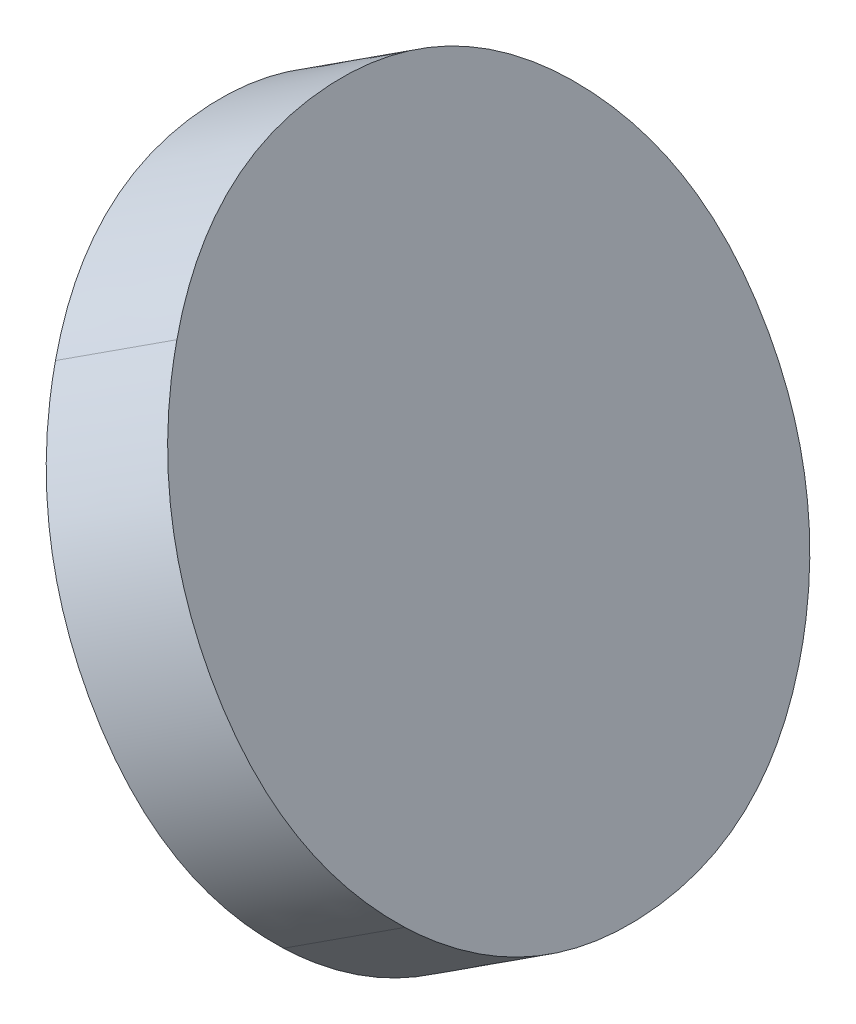
ISO-10303-21;
HEADER;
FILE_DESCRIPTION(('STEP AP214'),'2;1');
FILE_NAME('part.step','',(''),(''),'','','');
FILE_SCHEMA(('AUTOMOTIVE_DESIGN { 1 0 10303 214 1 1 1 1 }'));
ENDSEC;
DATA;
#1=APPLICATION_CONTEXT('core data for automotive mechanical design processes');
#2=APPLICATION_PROTOCOL_DEFINITION('international standard','automotive_design',2000,#1);
#3=PRODUCT_CONTEXT('',#1,'mechanical');
#4=PRODUCT('Part','Part','',(#3));
#5=PRODUCT_RELATED_PRODUCT_CATEGORY('part','',(#4));
#6=PRODUCT_DEFINITION_FORMATION('','',#4);
#7=PRODUCT_DEFINITION_CONTEXT('part definition',#1,'design');
#8=PRODUCT_DEFINITION('design','',#6,#7);
#9=PRODUCT_DEFINITION_SHAPE('','',#8);
#10=(LENGTH_UNIT() NAMED_UNIT(*) SI_UNIT(.MILLI.,.METRE.));
#11=(NAMED_UNIT(*) PLANE_ANGLE_UNIT() SI_UNIT($,.RADIAN.));
#12=(NAMED_UNIT(*) SI_UNIT($,.STERADIAN.) SOLID_ANGLE_UNIT());
#13=UNCERTAINTY_MEASURE_WITH_UNIT(LENGTH_MEASURE(1.E-05),#10,'distance_accuracy_value','');
#14=(GEOMETRIC_REPRESENTATION_CONTEXT(3) GLOBAL_UNCERTAINTY_ASSIGNED_CONTEXT((#13)) GLOBAL_UNIT_ASSIGNED_CONTEXT((#10,
#11,#12)) REPRESENTATION_CONTEXT('',''));
#15=CARTESIAN_POINT('',(0.,0.,0.));
#16=DIRECTION('',(0.,0.,1.));
#17=DIRECTION('',(1.,0.,0.));
#18=AXIS2_PLACEMENT_3D('',#15,#16,#17);
#19=CARTESIAN_POINT('',(7.28335065461328,6.00680934984333,1.91579914241559));
#20=DIRECTION('',(0.852868531952444,0.492403876506103,-0.17364817766693));
#21=DIRECTION('',(0.,-0.332579245006703,-0.943075312894348));
#22=AXIS2_PLACEMENT_3D('',#19,#20,#21);
#23=PLANE('',#22);
#24=CARTESIAN_POINT('',(7.16805054090355,6.2443999051349,2.02322711536579));
#25=CARTESIAN_POINT('',(7.19415428395629,6.17392212869858,1.95158530791309));
#26=CARTESIAN_POINT('',(7.23259707064947,6.09471713593486,1.91579914241559));
#27=CARTESIAN_POINT('',(7.33547992937375,5.91651879739647,1.91579914241559));
#28=CARTESIAN_POINT('',(7.38450520965769,5.84422465411598,1.95158530791309));
#29=CARTESIAN_POINT('',(7.43044004428371,5.78992795390772,2.02322711536579));
#30=B_SPLINE_CURVE_WITH_KNOTS('',3,(#24,#25,#26,#27,#28,#29),.UNSPECIFIED.,.F.,.F.,(4,2,4),(0.,
0.5,1.),.UNSPECIFIED.);
#31=CARTESIAN_POINT('',(7.16805054090355,6.2443999051349,2.02322711536579));
#32=VERTEX_POINT('',#31);
#33=CARTESIAN_POINT('',(7.43044004428371,5.78992795390772,2.02322711536579));
#34=VERTEX_POINT('',#33);
#35=EDGE_CURVE('E19',#32,#34,#30,.T.);
#36=ORIENTED_EDGE('',*,*,#35,.T.);
#37=CARTESIAN_POINT('',(7.43044004428371,5.78992795390772,2.02322711536579));
#38=CARTESIAN_POINT('',(7.4763474442193,5.73565614532244,2.09480476175079));
#39=CARTESIAN_POINT('',(7.50756220143503,5.71327279338527,2.18464408576989));
#40=CARTESIAN_POINT('',(7.54056952787439,5.73232958219027,2.40079692555009));
#41=CARTESIAN_POINT('',(7.5366985670963,5.77049988236137,2.49002206654359));
#42=CARTESIAN_POINT('',(7.51244373829389,5.83727280871904,2.56023914405359));
#43=B_SPLINE_CURVE_WITH_KNOTS('',3,(#37,#38,#39,#40,#41,#42),.UNSPECIFIED.,.F.,.F.,(4,2,4),(0.,
0.5,1.),.UNSPECIFIED.);
#44=CARTESIAN_POINT('',(7.51244373829389,5.83727280871904,2.56023914405359));
#45=VERTEX_POINT('',#44);
#46=EDGE_CURVE('E96',#34,#45,#43,.T.);
#47=ORIENTED_EDGE('',*,*,#46,.T.);
#48=CARTESIAN_POINT('',(7.51244373829389,5.83727280871904,2.56023914405359));
#49=CARTESIAN_POINT('',(7.4881722978072,5.9040768753652,2.63046293638199));
#50=CARTESIAN_POINT('',(7.44998265776649,5.98262697845697,2.66563539316839));
#51=CARTESIAN_POINT('',(7.3457211687353,6.16321317473178,2.66563539316839));
#52=CARTESIAN_POINT('',(7.29611351665096,6.23673244236755,2.63046293638199));
#53=CARTESIAN_POINT('',(7.24903422485724,6.29351146918832,2.56023914405359));
#54=B_SPLINE_CURVE_WITH_KNOTS('',3,(#48,#49,#50,#51,#52,#53),.UNSPECIFIED.,.F.,.F.,(4,2,4),(0.,
0.5,1.),.UNSPECIFIED.);
#55=CARTESIAN_POINT('',(7.24903422485724,6.29351146918832,2.56023914405359));
#56=VERTEX_POINT('',#55);
#57=EDGE_CURVE('E74',#45,#56,#54,.T.);
#58=ORIENTED_EDGE('',*,*,#57,.T.);
#59=CARTESIAN_POINT('',(7.24903422485724,6.29351146918832,2.56023914405359));
#60=CARTESIAN_POINT('',(7.20195595844076,6.35029108801092,2.49002206654359));
#61=CARTESIAN_POINT('',(7.17014714381323,6.37391997164499,2.40079692555009));
#62=CARTESIAN_POINT('',(7.13713981737387,6.35486318284,2.18464408576989));
#63=CARTESIAN_POINT('',(7.14194875826292,6.31485165938316,2.09480476175079));
#64=CARTESIAN_POINT('',(7.16805054090355,6.2443999051349,2.02322711536579));
#65=B_SPLINE_CURVE_WITH_KNOTS('',3,(#59,#60,#61,#62,#63,#64),.UNSPECIFIED.,.F.,.F.,(4,2,4),(0.,
0.5,1.),.UNSPECIFIED.);
#66=EDGE_CURVE('E27',#56,#32,#65,.T.);
#67=ORIENTED_EDGE('',*,*,#66,.T.);
#68=EDGE_LOOP('',(#36,#47,#58,#67));
#69=FACE_BOUND('',#68,.T.);
#70=ADVANCED_FACE('F16',(#69),#23,.F.);
#71=CARTESIAN_POINT('',(7.39989462778347,6.07409604412556,1.89207022312629));
#72=DIRECTION('',(0.852868531952444,0.492403876506103,-0.17364817766693));
#73=DIRECTION('',(0.,-0.332579245006703,-0.943075312894348));
#74=AXIS2_PLACEMENT_3D('',#71,#72,#73);
#75=PLANE('',#74);
#76=CARTESIAN_POINT('',(7.28459451407373,6.31168659941713,1.99949819607649));
#77=CARTESIAN_POINT('',(7.31069825712647,6.24120882298081,1.92785638862379));
#78=CARTESIAN_POINT('',(7.34914104381966,6.16200383021709,1.89207022312629));
#79=CARTESIAN_POINT('',(7.45202390254394,5.98380549167871,1.89207022312629));
#80=CARTESIAN_POINT('',(7.50104918282787,5.91151134839821,1.92785638862379));
#81=CARTESIAN_POINT('',(7.54698401745388,5.85721464818995,1.99949819607649));
#82=B_SPLINE_CURVE_WITH_KNOTS('',3,(#76,#77,#78,#79,#80,#81),.UNSPECIFIED.,.F.,.F.,(4,2,4),(0.,
0.5,1.),.UNSPECIFIED.);
#83=CARTESIAN_POINT('',(7.28459451407374,6.31168659941714,1.99949819607649));
#84=VERTEX_POINT('',#83);
#85=CARTESIAN_POINT('',(7.54698401745389,5.85721464818995,1.99949819607649));
#86=VERTEX_POINT('',#85);
#87=EDGE_CURVE('E84',#84,#86,#82,.T.);
#88=ORIENTED_EDGE('',*,*,#87,.F.);
#89=CARTESIAN_POINT('',(7.36557819802742,6.36079816347055,2.53651022476429));
#90=CARTESIAN_POINT('',(7.31849993161094,6.41757778229315,2.46629314725429));
#91=CARTESIAN_POINT('',(7.2866911169834,6.44120666592722,2.37706800626079));
#92=CARTESIAN_POINT('',(7.25368379054404,6.42214987712223,2.16091516648069));
#93=CARTESIAN_POINT('',(7.25849273143311,6.38213835366539,2.07107584246149));
#94=CARTESIAN_POINT('',(7.28459451407373,6.31168659941713,1.99949819607649));
#95=B_SPLINE_CURVE_WITH_KNOTS('',3,(#89,#90,#91,#92,#93,#94),.UNSPECIFIED.,.F.,.F.,(4,2,4),(0.,
0.5,1.),.UNSPECIFIED.);
#96=CARTESIAN_POINT('',(7.36557819802743,6.36079816347055,2.53651022476429));
#97=VERTEX_POINT('',#96);
#98=EDGE_CURVE('E11',#97,#84,#95,.T.);
#99=ORIENTED_EDGE('',*,*,#98,.F.);
#100=CARTESIAN_POINT('',(7.62898771146407,5.90455950300127,2.53651022476429));
#101=CARTESIAN_POINT('',(7.60471627097738,5.97136356964744,2.60673401709269));
#102=CARTESIAN_POINT('',(7.56652663093668,6.0499136727392,2.64190647387909));
#103=CARTESIAN_POINT('',(7.46226514190548,6.23049986901402,2.64190647387909));
#104=CARTESIAN_POINT('',(7.41265748982115,6.30401913664979,2.60673401709269));
#105=CARTESIAN_POINT('',(7.36557819802742,6.36079816347055,2.53651022476429));
#106=B_SPLINE_CURVE_WITH_KNOTS('',3,(#100,#101,#102,#103,#104,#105),.UNSPECIFIED.,.F.,.F.,(4,2,
4),(0.,0.5,1.),.UNSPECIFIED.);
#107=CARTESIAN_POINT('',(7.62898771146408,5.90455950300128,2.53651022476429));
#108=VERTEX_POINT('',#107);
#109=EDGE_CURVE('E105',#108,#97,#106,.T.);
#110=ORIENTED_EDGE('',*,*,#109,.F.);
#111=CARTESIAN_POINT('',(7.54698401745388,5.85721464818995,1.99949819607649));
#112=CARTESIAN_POINT('',(7.59289141738949,5.80294283960467,2.07107584246149));
#113=CARTESIAN_POINT('',(7.6241061746052,5.7805594876675,2.16091516648069));
#114=CARTESIAN_POINT('',(7.65711350104456,5.7996162764725,2.37706800626079));
#115=CARTESIAN_POINT('',(7.65324254026648,5.8377865766436,2.46629314725429));
#116=CARTESIAN_POINT('',(7.62898771146407,5.90455950300127,2.53651022476429));
#117=B_SPLINE_CURVE_WITH_KNOTS('',3,(#111,#112,#113,#114,#115,#116),.UNSPECIFIED.,.F.,.F.,(4,2,
4),(0.,0.5,1.),.UNSPECIFIED.);
#118=EDGE_CURVE('E99',#86,#108,#117,.T.);
#119=ORIENTED_EDGE('',*,*,#118,.F.);
#120=EDGE_LOOP('',(#88,#99,#110,#119));
#121=FACE_BOUND('',#120,.T.);
#122=ADVANCED_FACE('F158',(#121),#75,.T.);
#123=CARTESIAN_POINT('',(7.39116425398599,6.37557027976573,2.53130077943429));
#124=CARTESIAN_POINT('',(7.34408598756951,6.43234989858833,2.46108370192429));
#125=CARTESIAN_POINT('',(7.31227717294198,6.45597878222241,2.37185856093079));
#126=CARTESIAN_POINT('',(7.27926984650262,6.43692199341741,2.15570572115069));
#127=CARTESIAN_POINT('',(7.28407878739168,6.39691046996058,2.06586639713149));
#128=CARTESIAN_POINT('',(7.31018057003231,6.32645871571232,1.99428875074649));
#129=(BOUNDED_CURVE() B_SPLINE_CURVE(3,(#123,#124,#125,#126,#127,#128),.UNSPECIFIED.,.F.,
.F.) B_SPLINE_CURVE_WITH_KNOTS((4,2,4),(0.,0.5,1.),
.UNSPECIFIED.) CURVE() GEOMETRIC_REPRESENTATION_ITEM() RATIONAL_B_SPLINE_CURVE((1.,1.,1.,1.,1.,1.)) REPRESENTATION_ITEM(''));
#130=DIRECTION('',(-0.852868531952444,-0.492403876506103,0.17364817766693));
#131=VECTOR('',#130,1.);
#132=SURFACE_OF_LINEAR_EXTRUSION('',#129,#131);
#133=ORIENTED_EDGE('',*,*,#66,.F.);
#134=DIRECTION('',(-0.852868531952444,-0.492403876506103,0.17364817766693));
#135=VECTOR('',#134,1.);
#136=CARTESIAN_POINT('',(7.39116425398599,6.37557027976573,2.53130077943429));
#137=LINE('',#136,#135);
#138=EDGE_CURVE('E76',#97,#56,#137,.T.);
#139=ORIENTED_EDGE('',*,*,#138,.F.);
#140=ORIENTED_EDGE('',*,*,#98,.T.);
#141=DIRECTION('',(-0.852868531952444,-0.492403876506103,0.17364817766693));
#142=VECTOR('',#141,1.);
#143=CARTESIAN_POINT('',(7.31018057003231,6.32645871571232,1.99428875074649));
#144=LINE('',#143,#142);
#145=EDGE_CURVE('E79',#84,#32,#144,.T.);
#146=ORIENTED_EDGE('',*,*,#145,.T.);
#147=EDGE_LOOP('',(#133,#139,#140,#146));
#148=FACE_BOUND('',#147,.T.);
#149=ADVANCED_FACE('F80',(#148),#132,.T.);
#150=CARTESIAN_POINT('',(7.65457376742264,5.91933161929646,2.53130077943429));
#151=CARTESIAN_POINT('',(7.63030232693595,5.98613568594262,2.60152457176269));
#152=CARTESIAN_POINT('',(7.59211268689525,6.06468578903439,2.63669702854909));
#153=CARTESIAN_POINT('',(7.48785119786405,6.2452719853092,2.63669702854909));
#154=CARTESIAN_POINT('',(7.43824354577971,6.31879125294497,2.60152457176269));
#155=CARTESIAN_POINT('',(7.39116425398599,6.37557027976573,2.53130077943429));
#156=(BOUNDED_CURVE() B_SPLINE_CURVE(3,(#150,#151,#152,#153,#154,#155),.UNSPECIFIED.,.F.,
.F.) B_SPLINE_CURVE_WITH_KNOTS((4,2,4),(0.,0.5,1.),
.UNSPECIFIED.) CURVE() GEOMETRIC_REPRESENTATION_ITEM() RATIONAL_B_SPLINE_CURVE((1.,1.,1.,1.,1.,1.)) REPRESENTATION_ITEM(''));
#157=DIRECTION('',(-0.852868531952444,-0.492403876506103,0.17364817766693));
#158=VECTOR('',#157,1.);
#159=SURFACE_OF_LINEAR_EXTRUSION('',#156,#158);
#160=ORIENTED_EDGE('',*,*,#57,.F.);
#161=DIRECTION('',(-0.852868531952444,-0.492403876506103,0.17364817766693));
#162=VECTOR('',#161,1.);
#163=CARTESIAN_POINT('',(7.65457376742264,5.91933161929646,2.53130077943429));
#164=LINE('',#163,#162);
#165=EDGE_CURVE('E106',#108,#45,#164,.T.);
#166=ORIENTED_EDGE('',*,*,#165,.F.);
#167=ORIENTED_EDGE('',*,*,#109,.T.);
#168=ORIENTED_EDGE('',*,*,#138,.T.);
#169=EDGE_LOOP('',(#160,#166,#167,#168));
#170=FACE_BOUND('',#169,.T.);
#171=ADVANCED_FACE('F141',(#170),#159,.T.);
#172=CARTESIAN_POINT('',(7.57257007341246,5.87198676448513,1.99428875074649));
#173=CARTESIAN_POINT('',(7.61847747334806,5.81771495589985,2.06586639713149));
#174=CARTESIAN_POINT('',(7.64969223056378,5.79533160396269,2.15570572115069));
#175=CARTESIAN_POINT('',(7.68269955700314,5.81438839276769,2.37185856093079));
#176=CARTESIAN_POINT('',(7.67882859622505,5.85255869293878,2.46108370192429));
#177=CARTESIAN_POINT('',(7.65457376742264,5.91933161929646,2.53130077943429));
#178=(BOUNDED_CURVE() B_SPLINE_CURVE(3,(#172,#173,#174,#175,#176,#177),.UNSPECIFIED.,.F.,
.F.) B_SPLINE_CURVE_WITH_KNOTS((4,2,4),(0.,0.5,1.),
.UNSPECIFIED.) CURVE() GEOMETRIC_REPRESENTATION_ITEM() RATIONAL_B_SPLINE_CURVE((1.,1.,1.,1.,1.,1.)) REPRESENTATION_ITEM(''));
#179=DIRECTION('',(-0.852868531952444,-0.492403876506103,0.17364817766693));
#180=VECTOR('',#179,1.);
#181=SURFACE_OF_LINEAR_EXTRUSION('',#178,#180);
#182=ORIENTED_EDGE('',*,*,#46,.F.);
#183=DIRECTION('',(-0.852868531952444,-0.492403876506103,0.17364817766693));
#184=VECTOR('',#183,1.);
#185=CARTESIAN_POINT('',(7.57257007341246,5.87198676448513,1.99428875074649));
#186=LINE('',#185,#184);
#187=EDGE_CURVE('E89',#86,#34,#186,.T.);
#188=ORIENTED_EDGE('',*,*,#187,.F.);
#189=ORIENTED_EDGE('',*,*,#118,.T.);
#190=ORIENTED_EDGE('',*,*,#165,.T.);
#191=EDGE_LOOP('',(#182,#188,#189,#190));
#192=FACE_BOUND('',#191,.T.);
#193=ADVANCED_FACE('F132',(#192),#181,.T.);
#194=CARTESIAN_POINT('',(7.31018057003231,6.32645871571232,1.99428875074649));
#195=CARTESIAN_POINT('',(7.33628431308504,6.255980939276,1.92264694329379));
#196=CARTESIAN_POINT('',(7.37472709977822,6.17677594651227,1.88686077779629));
#197=CARTESIAN_POINT('',(7.4776099585025,5.99857760797389,1.88686077779629));
#198=CARTESIAN_POINT('',(7.52663523878645,5.9262834646934,1.92264694329379));
#199=CARTESIAN_POINT('',(7.57257007341246,5.87198676448513,1.99428875074649));
#200=(BOUNDED_CURVE() B_SPLINE_CURVE(3,(#194,#195,#196,#197,#198,#199),.UNSPECIFIED.,.F.,
.F.) B_SPLINE_CURVE_WITH_KNOTS((4,2,4),(0.,0.5,1.),
.UNSPECIFIED.) CURVE() GEOMETRIC_REPRESENTATION_ITEM() RATIONAL_B_SPLINE_CURVE((1.,1.,1.,1.,1.,1.)) REPRESENTATION_ITEM(''));
#201=DIRECTION('',(-0.852868531952444,-0.492403876506103,0.17364817766693));
#202=VECTOR('',#201,1.);
#203=SURFACE_OF_LINEAR_EXTRUSION('',#200,#202);
#204=ORIENTED_EDGE('',*,*,#35,.F.);
#205=ORIENTED_EDGE('',*,*,#145,.F.);
#206=ORIENTED_EDGE('',*,*,#87,.T.);
#207=ORIENTED_EDGE('',*,*,#187,.T.);
#208=EDGE_LOOP('',(#204,#205,#206,#207));
#209=FACE_BOUND('',#208,.T.);
#210=ADVANCED_FACE('F87',(#209),#203,.T.);
#211=CLOSED_SHELL('',(#70,#122,#149,#171,#193,#210));
#212=MANIFOLD_SOLID_BREP('B1',#211);
#213=ADVANCED_BREP_SHAPE_REPRESENTATION('',(#18,#212),#14);
#214=SHAPE_DEFINITION_REPRESENTATION(#9,#213);
ENDSEC;
END-ISO-10303-21;
